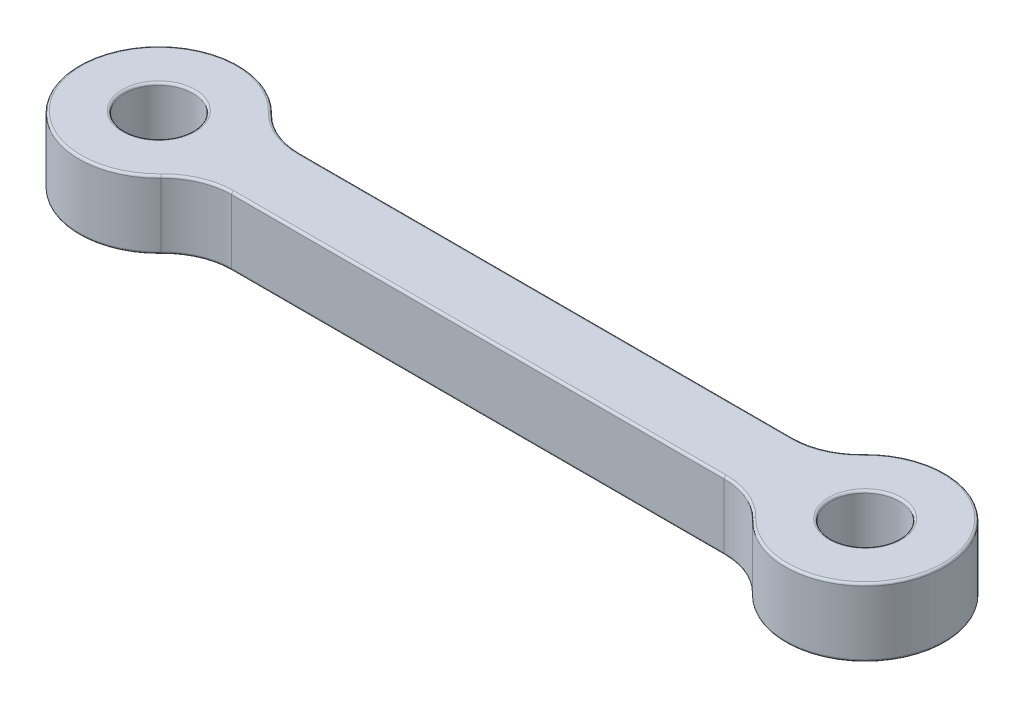
ISO-10303-21;
HEADER;
FILE_DESCRIPTION(('STEP AP214'),'2;1');
FILE_NAME('part.step','',(''),(''),'','','');
FILE_SCHEMA(('AUTOMOTIVE_DESIGN { 1 0 10303 214 1 1 1 1 }'));
ENDSEC;
DATA;
#1=APPLICATION_CONTEXT('core data for automotive mechanical design processes');
#2=APPLICATION_PROTOCOL_DEFINITION('international standard','automotive_design',2000,#1);
#3=PRODUCT_CONTEXT('',#1,'mechanical');
#4=PRODUCT('Part','Part','',(#3));
#5=PRODUCT_RELATED_PRODUCT_CATEGORY('part','',(#4));
#6=PRODUCT_DEFINITION_FORMATION('','',#4);
#7=PRODUCT_DEFINITION_CONTEXT('part definition',#1,'design');
#8=PRODUCT_DEFINITION('design','',#6,#7);
#9=PRODUCT_DEFINITION_SHAPE('','',#8);
#10=(LENGTH_UNIT() NAMED_UNIT(*) SI_UNIT(.MILLI.,.METRE.));
#11=(NAMED_UNIT(*) PLANE_ANGLE_UNIT() SI_UNIT($,.RADIAN.));
#12=(NAMED_UNIT(*) SI_UNIT($,.STERADIAN.) SOLID_ANGLE_UNIT());
#13=UNCERTAINTY_MEASURE_WITH_UNIT(LENGTH_MEASURE(1.E-05),#10,'distance_accuracy_value','');
#14=(GEOMETRIC_REPRESENTATION_CONTEXT(3) GLOBAL_UNCERTAINTY_ASSIGNED_CONTEXT((#13)) GLOBAL_UNIT_ASSIGNED_CONTEXT((#10,
#11,#12)) REPRESENTATION_CONTEXT('',''));
#15=CARTESIAN_POINT('',(0.,0.,0.));
#16=DIRECTION('',(0.,0.,1.));
#17=DIRECTION('',(1.,0.,0.));
#18=AXIS2_PLACEMENT_3D('',#15,#16,#17);
#19=CARTESIAN_POINT('',(-12.4,4.2,-2.7));
#20=DIRECTION('',(0.,0.,-1.));
#21=DIRECTION('',(-1.,0.,0.));
#22=AXIS2_PLACEMENT_3D('',#19,#20,#21);
#23=PLANE('',#22);
#24=DIRECTION('',(0.,-1.,0.));
#25=VECTOR('',#24,1.);
#26=CARTESIAN_POINT('',(34.9572516323178,4.2,-2.7));
#27=LINE('',#26,#25);
#28=CARTESIAN_POINT('',(34.9572516323178,4.02,-2.7));
#29=VERTEX_POINT('',#28);
#30=CARTESIAN_POINT('',(34.9572516323178,-1.02,-2.7));
#31=VERTEX_POINT('',#30);
#32=EDGE_CURVE('E295',#29,#31,#27,.T.);
#33=ORIENTED_EDGE('',*,*,#32,.T.);
#34=DIRECTION('',(1.,0.,0.));
#35=VECTOR('',#34,1.);
#36=CARTESIAN_POINT('',(-3.95725163231782,-1.02,-2.7));
#37=LINE('',#36,#35);
#38=CARTESIAN_POINT('',(-3.95725163231782,-1.02,-2.7));
#39=VERTEX_POINT('',#38);
#40=EDGE_CURVE('E242',#31,#39,#37,.F.);
#41=ORIENTED_EDGE('',*,*,#40,.T.);
#42=DIRECTION('',(0.,-1.,0.));
#43=VECTOR('',#42,1.);
#44=CARTESIAN_POINT('',(-3.95725163231782,4.2,-2.7));
#45=LINE('',#44,#43);
#46=CARTESIAN_POINT('',(-3.95725163231782,4.02,-2.7));
#47=VERTEX_POINT('',#46);
#48=EDGE_CURVE('E175',#47,#39,#45,.T.);
#49=ORIENTED_EDGE('',*,*,#48,.F.);
#50=DIRECTION('',(1.,0.,0.));
#51=VECTOR('',#50,1.);
#52=CARTESIAN_POINT('',(-12.4,4.02,-2.7));
#53=LINE('',#52,#51);
#54=EDGE_CURVE('E240',#47,#29,#53,.T.);
#55=ORIENTED_EDGE('',*,*,#54,.T.);
#56=EDGE_LOOP('',(#33,#41,#49,#55));
#57=FACE_BOUND('',#56,.T.);
#58=ADVANCED_FACE('F39',(#57),#23,.T.);
#59=CARTESIAN_POINT('',(-3.95725163231782,4.2,-8.1));
#60=DIRECTION('',(0.,-1.,0.));
#61=DIRECTION('',(0.,0.,-1.));
#62=AXIS2_PLACEMENT_3D('',#59,#60,#61);
#63=CYLINDRICAL_SURFACE('',#62,5.4);
#64=ORIENTED_EDGE('',*,*,#48,.T.);
#65=CARTESIAN_POINT('',(-3.95725163231782,-1.02,-8.1));
#66=DIRECTION('',(0.,1.,0.));
#67=DIRECTION('',(0.,0.,1.));
#68=AXIS2_PLACEMENT_3D('',#65,#66,#67);
#69=CIRCLE('',#68,5.4);
#70=CARTESIAN_POINT('',(-7.85390472509421,-1.02,-4.36153846153846));
#71=VERTEX_POINT('',#70);
#72=EDGE_CURVE('E174',#39,#71,#69,.F.);
#73=ORIENTED_EDGE('',*,*,#72,.T.);
#74=DIRECTION('',(0.,-1.,0.));
#75=VECTOR('',#74,1.);
#76=CARTESIAN_POINT('',(-7.85390472509421,4.2,-4.36153846153846));
#77=LINE('',#76,#75);
#78=CARTESIAN_POINT('',(-7.85390472509421,4.02,-4.36153846153846));
#79=VERTEX_POINT('',#78);
#80=EDGE_CURVE('E156',#79,#71,#77,.T.);
#81=ORIENTED_EDGE('',*,*,#80,.F.);
#82=CARTESIAN_POINT('',(-3.95725163231782,4.02,-8.1));
#83=DIRECTION('',(0.,1.,0.));
#84=DIRECTION('',(0.,0.,1.));
#85=AXIS2_PLACEMENT_3D('',#82,#83,#84);
#86=CIRCLE('',#85,5.4);
#87=EDGE_CURVE('E171',#79,#47,#86,.T.);
#88=ORIENTED_EDGE('',*,*,#87,.T.);
#89=EDGE_LOOP('',(#64,#73,#81,#88));
#90=FACE_BOUND('',#89,.T.);
#91=ADVANCED_FACE('F169',(#90),#63,.F.);
#92=CARTESIAN_POINT('',(-12.4,4.2,0.));
#93=DIRECTION('',(0.,-1.,0.));
#94=DIRECTION('',(0.,0.,-1.));
#95=AXIS2_PLACEMENT_3D('',#92,#93,#94);
#96=CYLINDRICAL_SURFACE('',#95,6.3);
#97=ORIENTED_EDGE('',*,*,#80,.T.);
#98=CARTESIAN_POINT('',(-12.4,-1.02,0.));
#99=DIRECTION('',(0.,1.,0.));
#100=DIRECTION('',(0.,0.,1.));
#101=AXIS2_PLACEMENT_3D('',#98,#99,#100);
#102=CIRCLE('',#101,6.3);
#103=CARTESIAN_POINT('',(-7.85390472509421,-1.02,4.36153846153846));
#104=VERTEX_POINT('',#103);
#105=EDGE_CURVE('E163',#71,#104,#102,.T.);
#106=ORIENTED_EDGE('',*,*,#105,.T.);
#107=DIRECTION('',(0.,-1.,0.));
#108=VECTOR('',#107,1.);
#109=CARTESIAN_POINT('',(-7.85390472509421,4.2,4.36153846153846));
#110=LINE('',#109,#108);
#111=CARTESIAN_POINT('',(-7.85390472509421,4.02,4.36153846153846));
#112=VERTEX_POINT('',#111);
#113=EDGE_CURVE('E158',#112,#104,#110,.T.);
#114=ORIENTED_EDGE('',*,*,#113,.F.);
#115=CARTESIAN_POINT('',(-12.4,4.02,0.));
#116=DIRECTION('',(0.,1.,0.));
#117=DIRECTION('',(0.,0.,1.));
#118=AXIS2_PLACEMENT_3D('',#115,#116,#117);
#119=CIRCLE('',#118,6.3);
#120=EDGE_CURVE('E153',#112,#79,#119,.F.);
#121=ORIENTED_EDGE('',*,*,#120,.T.);
#122=EDGE_LOOP('',(#97,#106,#114,#121));
#123=FACE_BOUND('',#122,.T.);
#124=ADVANCED_FACE('F155',(#123),#96,.T.);
#125=CARTESIAN_POINT('',(-3.95725163231782,4.2,8.1));
#126=DIRECTION('',(0.,-1.,0.));
#127=DIRECTION('',(0.,0.,-1.));
#128=AXIS2_PLACEMENT_3D('',#125,#126,#127);
#129=CYLINDRICAL_SURFACE('',#128,5.4);
#130=ORIENTED_EDGE('',*,*,#113,.T.);
#131=CARTESIAN_POINT('',(-3.95725163231782,-1.02,8.1));
#132=DIRECTION('',(0.,1.,0.));
#133=DIRECTION('',(0.,0.,1.));
#134=AXIS2_PLACEMENT_3D('',#131,#132,#133);
#135=CIRCLE('',#134,5.4);
#136=CARTESIAN_POINT('',(-3.95725163231782,-1.02,2.7));
#137=VERTEX_POINT('',#136);
#138=EDGE_CURVE('E221',#104,#137,#135,.F.);
#139=ORIENTED_EDGE('',*,*,#138,.T.);
#140=DIRECTION('',(0.,-1.,0.));
#141=VECTOR('',#140,1.);
#142=CARTESIAN_POINT('',(-3.95725163231782,4.2,2.7));
#143=LINE('',#142,#141);
#144=CARTESIAN_POINT('',(-3.95725163231782,4.02,2.7));
#145=VERTEX_POINT('',#144);
#146=EDGE_CURVE('E341',#145,#137,#143,.T.);
#147=ORIENTED_EDGE('',*,*,#146,.F.);
#148=CARTESIAN_POINT('',(-3.95725163231782,4.02,8.1));
#149=DIRECTION('',(0.,1.,0.));
#150=DIRECTION('',(0.,0.,1.));
#151=AXIS2_PLACEMENT_3D('',#148,#149,#150);
#152=CIRCLE('',#151,5.4);
#153=EDGE_CURVE('E219',#145,#112,#152,.T.);
#154=ORIENTED_EDGE('',*,*,#153,.T.);
#155=EDGE_LOOP('',(#130,#139,#147,#154));
#156=FACE_BOUND('',#155,.T.);
#157=ADVANCED_FACE('F346',(#156),#129,.F.);
#158=CARTESIAN_POINT('',(-12.4,4.2,2.7));
#159=DIRECTION('',(0.,0.,-1.));
#160=DIRECTION('',(-1.,0.,0.));
#161=AXIS2_PLACEMENT_3D('',#158,#159,#160);
#162=PLANE('',#161);
#163=ORIENTED_EDGE('',*,*,#146,.T.);
#164=DIRECTION('',(1.,0.,0.));
#165=VECTOR('',#164,1.);
#166=CARTESIAN_POINT('',(-12.4,-1.02,2.7));
#167=LINE('',#166,#165);
#168=CARTESIAN_POINT('',(34.9572516323178,-1.02,2.7));
#169=VERTEX_POINT('',#168);
#170=EDGE_CURVE('E225',#137,#169,#167,.T.);
#171=ORIENTED_EDGE('',*,*,#170,.T.);
#172=DIRECTION('',(0.,-1.,0.));
#173=VECTOR('',#172,1.);
#174=CARTESIAN_POINT('',(34.9572516323178,4.2,2.7));
#175=LINE('',#174,#173);
#176=CARTESIAN_POINT('',(34.9572516323178,4.02,2.7));
#177=VERTEX_POINT('',#176);
#178=EDGE_CURVE('E338',#177,#169,#175,.T.);
#179=ORIENTED_EDGE('',*,*,#178,.F.);
#180=DIRECTION('',(1.,0.,0.));
#181=VECTOR('',#180,1.);
#182=CARTESIAN_POINT('',(-3.95725163231782,4.02,2.7));
#183=LINE('',#182,#181);
#184=EDGE_CURVE('E223',#177,#145,#183,.F.);
#185=ORIENTED_EDGE('',*,*,#184,.T.);
#186=EDGE_LOOP('',(#163,#171,#179,#185));
#187=FACE_BOUND('',#186,.T.);
#188=ADVANCED_FACE('F389',(#187),#162,.F.);
#189=CARTESIAN_POINT('',(34.9572516323178,4.2,8.1));
#190=DIRECTION('',(0.,-1.,0.));
#191=DIRECTION('',(0.,0.,-1.));
#192=AXIS2_PLACEMENT_3D('',#189,#190,#191);
#193=CYLINDRICAL_SURFACE('',#192,5.4);
#194=ORIENTED_EDGE('',*,*,#178,.T.);
#195=CARTESIAN_POINT('',(34.9572516323178,-1.02,8.1));
#196=DIRECTION('',(0.,1.,0.));
#197=DIRECTION('',(0.,0.,1.));
#198=AXIS2_PLACEMENT_3D('',#195,#196,#197);
#199=CIRCLE('',#198,5.4);
#200=CARTESIAN_POINT('',(38.8539047250942,-1.02,4.36153846153846));
#201=VERTEX_POINT('',#200);
#202=EDGE_CURVE('E229',#169,#201,#199,.F.);
#203=ORIENTED_EDGE('',*,*,#202,.T.);
#204=DIRECTION('',(0.,-1.,0.));
#205=VECTOR('',#204,1.);
#206=CARTESIAN_POINT('',(38.8539047250942,4.2,4.36153846153846));
#207=LINE('',#206,#205);
#208=CARTESIAN_POINT('',(38.8539047250942,4.02,4.36153846153846));
#209=VERTEX_POINT('',#208);
#210=EDGE_CURVE('E333',#209,#201,#207,.T.);
#211=ORIENTED_EDGE('',*,*,#210,.F.);
#212=CARTESIAN_POINT('',(34.9572516323178,4.02,8.1));
#213=DIRECTION('',(0.,1.,0.));
#214=DIRECTION('',(0.,0.,1.));
#215=AXIS2_PLACEMENT_3D('',#212,#213,#214);
#216=CIRCLE('',#215,5.4);
#217=EDGE_CURVE('E227',#209,#177,#216,.T.);
#218=ORIENTED_EDGE('',*,*,#217,.T.);
#219=EDGE_LOOP('',(#194,#203,#211,#218));
#220=FACE_BOUND('',#219,.T.);
#221=ADVANCED_FACE('F391',(#220),#193,.F.);
#222=CARTESIAN_POINT('',(43.4,4.2,0.));
#223=DIRECTION('',(0.,-1.,0.));
#224=DIRECTION('',(0.,0.,-1.));
#225=AXIS2_PLACEMENT_3D('',#222,#223,#224);
#226=CYLINDRICAL_SURFACE('',#225,6.3);
#227=ORIENTED_EDGE('',*,*,#210,.T.);
#228=CARTESIAN_POINT('',(43.4,-1.02,0.));
#229=DIRECTION('',(0.,1.,0.));
#230=DIRECTION('',(0.,0.,1.));
#231=AXIS2_PLACEMENT_3D('',#228,#229,#230);
#232=CIRCLE('',#231,6.3);
#233=CARTESIAN_POINT('',(38.8539047250942,-1.02,-4.36153846153846));
#234=VERTEX_POINT('',#233);
#235=EDGE_CURVE('E233',#201,#234,#232,.T.);
#236=ORIENTED_EDGE('',*,*,#235,.T.);
#237=DIRECTION('',(0.,-1.,0.));
#238=VECTOR('',#237,1.);
#239=CARTESIAN_POINT('',(38.8539047250942,4.2,-4.36153846153846));
#240=LINE('',#239,#238);
#241=CARTESIAN_POINT('',(38.8539047250942,4.02,-4.36153846153846));
#242=VERTEX_POINT('',#241);
#243=EDGE_CURVE('E331',#242,#234,#240,.T.);
#244=ORIENTED_EDGE('',*,*,#243,.F.);
#245=CARTESIAN_POINT('',(43.4,4.02,0.));
#246=DIRECTION('',(0.,1.,0.));
#247=DIRECTION('',(0.,0.,1.));
#248=AXIS2_PLACEMENT_3D('',#245,#246,#247);
#249=CIRCLE('',#248,6.3);
#250=EDGE_CURVE('E231',#242,#209,#249,.F.);
#251=ORIENTED_EDGE('',*,*,#250,.T.);
#252=EDGE_LOOP('',(#227,#236,#244,#251));
#253=FACE_BOUND('',#252,.T.);
#254=ADVANCED_FACE('F424',(#253),#226,.T.);
#255=CARTESIAN_POINT('',(43.4,4.2,0.));
#256=DIRECTION('',(0.,-1.,0.));
#257=DIRECTION('',(0.,0.,-1.));
#258=AXIS2_PLACEMENT_3D('',#255,#256,#257);
#259=CYLINDRICAL_SURFACE('',#258,2.70000000000001);
#260=CARTESIAN_POINT('',(43.4,-1.02,0.));
#261=DIRECTION('',(0.,1.,0.));
#262=DIRECTION('',(0.,0.,1.));
#263=AXIS2_PLACEMENT_3D('',#260,#261,#262);
#264=CIRCLE('',#263,2.70000000000001);
#265=CARTESIAN_POINT('',(43.4,-1.02,2.70000000000001));
#266=VERTEX_POINT('',#265);
#267=EDGE_CURVE('E247',#266,#266,#264,.F.);
#268=ORIENTED_EDGE('',*,*,#267,.T.);
#269=EDGE_LOOP('',(#268));
#270=FACE_BOUND('',#269,.T.);
#271=CARTESIAN_POINT('',(43.4,4.02,0.));
#272=DIRECTION('',(0.,1.,0.));
#273=DIRECTION('',(0.,0.,1.));
#274=AXIS2_PLACEMENT_3D('',#271,#272,#273);
#275=CIRCLE('',#274,2.70000000000001);
#276=CARTESIAN_POINT('',(43.4,4.02,2.70000000000001));
#277=VERTEX_POINT('',#276);
#278=EDGE_CURVE('E244',#277,#277,#275,.T.);
#279=ORIENTED_EDGE('',*,*,#278,.T.);
#280=EDGE_LOOP('',(#279));
#281=FACE_BOUND('',#280,.T.);
#282=ADVANCED_FACE('F420',(#270,#281),#259,.F.);
#283=CARTESIAN_POINT('',(-12.4,4.2,0.));
#284=DIRECTION('',(0.,-1.,0.));
#285=DIRECTION('',(0.,0.,-1.));
#286=AXIS2_PLACEMENT_3D('',#283,#284,#285);
#287=CYLINDRICAL_SURFACE('',#286,2.7);
#288=CARTESIAN_POINT('',(-12.4,-1.02,0.));
#289=DIRECTION('',(0.,1.,0.));
#290=DIRECTION('',(0.,0.,1.));
#291=AXIS2_PLACEMENT_3D('',#288,#289,#290);
#292=CIRCLE('',#291,2.7);
#293=CARTESIAN_POINT('',(-12.4,-1.02,2.7));
#294=VERTEX_POINT('',#293);
#295=EDGE_CURVE('E253',#294,#294,#292,.F.);
#296=ORIENTED_EDGE('',*,*,#295,.T.);
#297=EDGE_LOOP('',(#296));
#298=FACE_BOUND('',#297,.T.);
#299=CARTESIAN_POINT('',(-12.4,4.02,0.));
#300=DIRECTION('',(0.,1.,0.));
#301=DIRECTION('',(0.,0.,1.));
#302=AXIS2_PLACEMENT_3D('',#299,#300,#301);
#303=CIRCLE('',#302,2.7);
#304=CARTESIAN_POINT('',(-12.4,4.02,2.7));
#305=VERTEX_POINT('',#304);
#306=EDGE_CURVE('E250',#305,#305,#303,.T.);
#307=ORIENTED_EDGE('',*,*,#306,.T.);
#308=EDGE_LOOP('',(#307));
#309=FACE_BOUND('',#308,.T.);
#310=ADVANCED_FACE('F423',(#298,#309),#287,.F.);
#311=CARTESIAN_POINT('',(34.9572516323178,4.2,-8.1));
#312=DIRECTION('',(0.,-1.,0.));
#313=DIRECTION('',(0.,0.,-1.));
#314=AXIS2_PLACEMENT_3D('',#311,#312,#313);
#315=CYLINDRICAL_SURFACE('',#314,5.4);
#316=ORIENTED_EDGE('',*,*,#243,.T.);
#317=CARTESIAN_POINT('',(34.9572516323178,-1.02,-8.1));
#318=DIRECTION('',(0.,1.,0.));
#319=DIRECTION('',(0.,0.,1.));
#320=AXIS2_PLACEMENT_3D('',#317,#318,#319);
#321=CIRCLE('',#320,5.4);
#322=EDGE_CURVE('E238',#234,#31,#321,.F.);
#323=ORIENTED_EDGE('',*,*,#322,.T.);
#324=ORIENTED_EDGE('',*,*,#32,.F.);
#325=CARTESIAN_POINT('',(34.9572516323178,4.02,-8.1));
#326=DIRECTION('',(0.,1.,0.));
#327=DIRECTION('',(0.,0.,1.));
#328=AXIS2_PLACEMENT_3D('',#325,#326,#327);
#329=CIRCLE('',#328,5.4);
#330=EDGE_CURVE('E235',#29,#242,#329,.T.);
#331=ORIENTED_EDGE('',*,*,#330,.T.);
#332=EDGE_LOOP('',(#316,#323,#324,#331));
#333=FACE_BOUND('',#332,.T.);
#334=ADVANCED_FACE('F328',(#333),#315,.F.);
#335=CARTESIAN_POINT('',(-12.4,4.2,0.));
#336=DIRECTION('',(0.,1.,0.));
#337=DIRECTION('',(0.,0.,1.));
#338=AXIS2_PLACEMENT_3D('',#335,#336,#337);
#339=PLANE('',#338);
#340=CARTESIAN_POINT('',(43.4,4.2,0.));
#341=DIRECTION('',(0.,1.,0.));
#342=DIRECTION('',(0.,0.,1.));
#343=AXIS2_PLACEMENT_3D('',#340,#341,#342);
#344=CIRCLE('',#343,6.12);
#345=CARTESIAN_POINT('',(38.9837931615201,4.2,4.23692307692308));
#346=VERTEX_POINT('',#345);
#347=CARTESIAN_POINT('',(38.9837931615201,4.2,-4.23692307692308));
#348=VERTEX_POINT('',#347);
#349=EDGE_CURVE('E48',#346,#348,#344,.T.);
#350=ORIENTED_EDGE('',*,*,#349,.T.);
#351=CARTESIAN_POINT('',(34.9572516323178,4.2,-8.1));
#352=DIRECTION('',(0.,1.,0.));
#353=DIRECTION('',(0.,0.,1.));
#354=AXIS2_PLACEMENT_3D('',#351,#352,#353);
#355=CIRCLE('',#354,5.58);
#356=CARTESIAN_POINT('',(34.9572516323178,4.2,-2.52));
#357=VERTEX_POINT('',#356);
#358=EDGE_CURVE('E11',#348,#357,#355,.F.);
#359=ORIENTED_EDGE('',*,*,#358,.T.);
#360=DIRECTION('',(1.,0.,0.));
#361=VECTOR('',#360,1.);
#362=CARTESIAN_POINT('',(-12.4,4.2,-2.52));
#363=LINE('',#362,#361);
#364=CARTESIAN_POINT('',(-3.95725163231782,4.2,-2.52));
#365=VERTEX_POINT('',#364);
#366=EDGE_CURVE('E262',#357,#365,#363,.F.);
#367=ORIENTED_EDGE('',*,*,#366,.T.);
#368=CARTESIAN_POINT('',(-3.95725163231782,4.2,-8.1));
#369=DIRECTION('',(0.,1.,0.));
#370=DIRECTION('',(0.,0.,1.));
#371=AXIS2_PLACEMENT_3D('',#368,#369,#370);
#372=CIRCLE('',#371,5.58);
#373=CARTESIAN_POINT('',(-7.98379316152008,4.2,-4.23692307692308));
#374=VERTEX_POINT('',#373);
#375=EDGE_CURVE('E264',#365,#374,#372,.F.);
#376=ORIENTED_EDGE('',*,*,#375,.T.);
#377=CARTESIAN_POINT('',(-12.4,4.2,0.));
#378=DIRECTION('',(0.,1.,0.));
#379=DIRECTION('',(0.,0.,1.));
#380=AXIS2_PLACEMENT_3D('',#377,#378,#379);
#381=CIRCLE('',#380,6.12);
#382=CARTESIAN_POINT('',(-7.98379316152008,4.2,4.23692307692308));
#383=VERTEX_POINT('',#382);
#384=EDGE_CURVE('E181',#374,#383,#381,.T.);
#385=ORIENTED_EDGE('',*,*,#384,.T.);
#386=CARTESIAN_POINT('',(-3.95725163231782,4.2,8.1));
#387=DIRECTION('',(0.,1.,0.));
#388=DIRECTION('',(0.,0.,1.));
#389=AXIS2_PLACEMENT_3D('',#386,#387,#388);
#390=CIRCLE('',#389,5.58);
#391=CARTESIAN_POINT('',(-3.95725163231782,4.2,2.52));
#392=VERTEX_POINT('',#391);
#393=EDGE_CURVE('E267',#383,#392,#390,.F.);
#394=ORIENTED_EDGE('',*,*,#393,.T.);
#395=DIRECTION('',(1.,0.,0.));
#396=VECTOR('',#395,1.);
#397=CARTESIAN_POINT('',(34.9572516323178,4.2,2.52));
#398=LINE('',#397,#396);
#399=CARTESIAN_POINT('',(34.9572516323178,4.2,2.52));
#400=VERTEX_POINT('',#399);
#401=EDGE_CURVE('E269',#392,#400,#398,.T.);
#402=ORIENTED_EDGE('',*,*,#401,.T.);
#403=CARTESIAN_POINT('',(34.9572516323178,4.2,8.1));
#404=DIRECTION('',(0.,1.,0.));
#405=DIRECTION('',(0.,0.,1.));
#406=AXIS2_PLACEMENT_3D('',#403,#404,#405);
#407=CIRCLE('',#406,5.58);
#408=EDGE_CURVE('E59',#400,#346,#407,.F.);
#409=ORIENTED_EDGE('',*,*,#408,.T.);
#410=EDGE_LOOP('',(#350,#359,#367,#376,#385,#394,#402,#409));
#411=FACE_BOUND('',#410,.T.);
#412=CARTESIAN_POINT('',(43.4,4.2,0.));
#413=DIRECTION('',(0.,1.,0.));
#414=DIRECTION('',(0.,0.,1.));
#415=AXIS2_PLACEMENT_3D('',#412,#413,#414);
#416=CIRCLE('',#415,2.88000000000001);
#417=CARTESIAN_POINT('',(43.4,4.2,2.88000000000001));
#418=VERTEX_POINT('',#417);
#419=EDGE_CURVE('E259',#418,#418,#416,.F.);
#420=ORIENTED_EDGE('',*,*,#419,.T.);
#421=EDGE_LOOP('',(#420));
#422=FACE_BOUND('',#421,.T.);
#423=CARTESIAN_POINT('',(-12.4,4.2,0.));
#424=DIRECTION('',(0.,1.,0.));
#425=DIRECTION('',(0.,0.,1.));
#426=AXIS2_PLACEMENT_3D('',#423,#424,#425);
#427=CIRCLE('',#426,2.88);
#428=CARTESIAN_POINT('',(-12.4,4.2,2.88));
#429=VERTEX_POINT('',#428);
#430=EDGE_CURVE('E256',#429,#429,#427,.F.);
#431=ORIENTED_EDGE('',*,*,#430,.T.);
#432=EDGE_LOOP('',(#431));
#433=FACE_BOUND('',#432,.T.);
#434=ADVANCED_FACE('F314',(#411,#422,#433),#339,.T.);
#435=CARTESIAN_POINT('',(-12.4,-1.2,0.));
#436=DIRECTION('',(0.,1.,0.));
#437=DIRECTION('',(0.,0.,1.));
#438=AXIS2_PLACEMENT_3D('',#435,#436,#437);
#439=PLANE('',#438);
#440=CARTESIAN_POINT('',(-12.4,-1.2,0.));
#441=DIRECTION('',(0.,1.,0.));
#442=DIRECTION('',(0.,0.,1.));
#443=AXIS2_PLACEMENT_3D('',#440,#441,#442);
#444=CIRCLE('',#443,6.12);
#445=CARTESIAN_POINT('',(-7.98379316152008,-1.2,4.23692307692308));
#446=VERTEX_POINT('',#445);
#447=CARTESIAN_POINT('',(-7.98379316152008,-1.2,-4.23692307692308));
#448=VERTEX_POINT('',#447);
#449=EDGE_CURVE('E214',#446,#448,#444,.F.);
#450=ORIENTED_EDGE('',*,*,#449,.T.);
#451=CARTESIAN_POINT('',(-3.95725163231782,-1.2,-8.1));
#452=DIRECTION('',(0.,1.,0.));
#453=DIRECTION('',(0.,0.,1.));
#454=AXIS2_PLACEMENT_3D('',#451,#452,#453);
#455=CIRCLE('',#454,5.58);
#456=CARTESIAN_POINT('',(-3.95725163231782,-1.2,-2.52));
#457=VERTEX_POINT('',#456);
#458=EDGE_CURVE('E164',#448,#457,#455,.T.);
#459=ORIENTED_EDGE('',*,*,#458,.T.);
#460=DIRECTION('',(1.,0.,0.));
#461=VECTOR('',#460,1.);
#462=CARTESIAN_POINT('',(34.9572516323178,-1.2,-2.52));
#463=LINE('',#462,#461);
#464=CARTESIAN_POINT('',(34.9572516323178,-1.2,-2.52));
#465=VERTEX_POINT('',#464);
#466=EDGE_CURVE('E202',#457,#465,#463,.T.);
#467=ORIENTED_EDGE('',*,*,#466,.T.);
#468=CARTESIAN_POINT('',(34.9572516323178,-1.2,-8.1));
#469=DIRECTION('',(0.,1.,0.));
#470=DIRECTION('',(0.,0.,1.));
#471=AXIS2_PLACEMENT_3D('',#468,#469,#470);
#472=CIRCLE('',#471,5.58);
#473=CARTESIAN_POINT('',(38.9837931615201,-1.2,-4.23692307692308));
#474=VERTEX_POINT('',#473);
#475=EDGE_CURVE('E204',#465,#474,#472,.T.);
#476=ORIENTED_EDGE('',*,*,#475,.T.);
#477=CARTESIAN_POINT('',(43.4,-1.2,0.));
#478=DIRECTION('',(0.,1.,0.));
#479=DIRECTION('',(0.,0.,1.));
#480=AXIS2_PLACEMENT_3D('',#477,#478,#479);
#481=CIRCLE('',#480,6.12);
#482=CARTESIAN_POINT('',(38.9837931615201,-1.2,4.23692307692308));
#483=VERTEX_POINT('',#482);
#484=EDGE_CURVE('E206',#474,#483,#481,.F.);
#485=ORIENTED_EDGE('',*,*,#484,.T.);
#486=CARTESIAN_POINT('',(34.9572516323178,-1.2,8.1));
#487=DIRECTION('',(0.,1.,0.));
#488=DIRECTION('',(0.,0.,1.));
#489=AXIS2_PLACEMENT_3D('',#486,#487,#488);
#490=CIRCLE('',#489,5.58);
#491=CARTESIAN_POINT('',(34.9572516323178,-1.2,2.52));
#492=VERTEX_POINT('',#491);
#493=EDGE_CURVE('E208',#483,#492,#490,.T.);
#494=ORIENTED_EDGE('',*,*,#493,.T.);
#495=DIRECTION('',(1.,0.,0.));
#496=VECTOR('',#495,1.);
#497=CARTESIAN_POINT('',(-12.4,-1.2,2.52));
#498=LINE('',#497,#496);
#499=CARTESIAN_POINT('',(-3.95725163231782,-1.2,2.52));
#500=VERTEX_POINT('',#499);
#501=EDGE_CURVE('E210',#492,#500,#498,.F.);
#502=ORIENTED_EDGE('',*,*,#501,.T.);
#503=CARTESIAN_POINT('',(-3.95725163231782,-1.2,8.1));
#504=DIRECTION('',(0.,1.,0.));
#505=DIRECTION('',(0.,0.,1.));
#506=AXIS2_PLACEMENT_3D('',#503,#504,#505);
#507=CIRCLE('',#506,5.58);
#508=EDGE_CURVE('E212',#500,#446,#507,.T.);
#509=ORIENTED_EDGE('',*,*,#508,.T.);
#510=EDGE_LOOP('',(#450,#459,#467,#476,#485,#494,#502,#509));
#511=FACE_BOUND('',#510,.T.);
#512=CARTESIAN_POINT('',(43.4,-1.2,0.));
#513=DIRECTION('',(0.,1.,0.));
#514=DIRECTION('',(0.,0.,1.));
#515=AXIS2_PLACEMENT_3D('',#512,#513,#514);
#516=CIRCLE('',#515,2.88000000000001);
#517=CARTESIAN_POINT('',(43.4,-1.2,2.88000000000001));
#518=VERTEX_POINT('',#517);
#519=EDGE_CURVE('E199',#518,#518,#516,.T.);
#520=ORIENTED_EDGE('',*,*,#519,.T.);
#521=EDGE_LOOP('',(#520));
#522=FACE_BOUND('',#521,.T.);
#523=CARTESIAN_POINT('',(-12.4,-1.2,0.));
#524=DIRECTION('',(0.,1.,0.));
#525=DIRECTION('',(0.,0.,1.));
#526=AXIS2_PLACEMENT_3D('',#523,#524,#525);
#527=CIRCLE('',#526,2.88);
#528=CARTESIAN_POINT('',(-12.4,-1.2,2.88));
#529=VERTEX_POINT('',#528);
#530=EDGE_CURVE('E193',#529,#529,#527,.T.);
#531=ORIENTED_EDGE('',*,*,#530,.T.);
#532=EDGE_LOOP('',(#531));
#533=FACE_BOUND('',#532,.T.);
#534=ADVANCED_FACE('F360',(#511,#522,#533),#439,.F.);
#535=CARTESIAN_POINT('',(34.9572516323178,-1.02,8.1));
#536=DIRECTION('',(0.,1.,0.));
#537=DIRECTION('',(0.,0.,1.));
#538=AXIS2_PLACEMENT_3D('',#535,#536,#537);
#539=TOROIDAL_SURFACE('',#538,5.58,0.18);
#540=CARTESIAN_POINT('',(34.9572516323178,-1.02,2.52));
#541=DIRECTION('',(-1.,0.,0.));
#542=DIRECTION('',(0.,0.,1.));
#543=AXIS2_PLACEMENT_3D('',#540,#541,#542);
#544=CIRCLE('',#543,0.18);
#545=EDGE_CURVE('E289',#492,#169,#544,.T.);
#546=ORIENTED_EDGE('',*,*,#545,.F.);
#547=ORIENTED_EDGE('',*,*,#493,.F.);
#548=CARTESIAN_POINT('',(38.9837931615201,-1.02,4.23692307692308));
#549=DIRECTION('',(0.692307692307693,0.,0.72160242458822));
#550=DIRECTION('',(0.72160242458822,0.,-0.692307692307693));
#551=AXIS2_PLACEMENT_3D('',#548,#549,#550);
#552=CIRCLE('',#551,0.18);
#553=EDGE_CURVE('E292',#201,#483,#552,.T.);
#554=ORIENTED_EDGE('',*,*,#553,.F.);
#555=ORIENTED_EDGE('',*,*,#202,.F.);
#556=EDGE_LOOP('',(#546,#547,#554,#555));
#557=FACE_BOUND('',#556,.T.);
#558=ADVANCED_FACE('F381',(#557),#539,.T.);
#559=CARTESIAN_POINT('',(43.4,-1.02,0.));
#560=DIRECTION('',(0.,1.,0.));
#561=DIRECTION('',(0.,0.,1.));
#562=AXIS2_PLACEMENT_3D('',#559,#560,#561);
#563=TOROIDAL_SURFACE('',#562,6.12,0.18);
#564=ORIENTED_EDGE('',*,*,#553,.T.);
#565=ORIENTED_EDGE('',*,*,#484,.F.);
#566=CARTESIAN_POINT('',(38.9837931615201,-1.02,-4.23692307692308));
#567=DIRECTION('',(-0.692307692307693,0.,0.72160242458822));
#568=DIRECTION('',(0.72160242458822,0.,0.692307692307693));
#569=AXIS2_PLACEMENT_3D('',#566,#567,#568);
#570=CIRCLE('',#569,0.18);
#571=EDGE_CURVE('E286',#234,#474,#570,.T.);
#572=ORIENTED_EDGE('',*,*,#571,.F.);
#573=ORIENTED_EDGE('',*,*,#235,.F.);
#574=EDGE_LOOP('',(#564,#565,#572,#573));
#575=FACE_BOUND('',#574,.T.);
#576=ADVANCED_FACE('F376',(#575),#563,.T.);
#577=CARTESIAN_POINT('',(-12.4,-1.02,2.52));
#578=DIRECTION('',(1.,0.,0.));
#579=DIRECTION('',(0.,0.,-1.));
#580=AXIS2_PLACEMENT_3D('',#577,#578,#579);
#581=CYLINDRICAL_SURFACE('',#580,0.18);
#582=ORIENTED_EDGE('',*,*,#545,.T.);
#583=ORIENTED_EDGE('',*,*,#170,.F.);
#584=CARTESIAN_POINT('',(-3.95725163231782,-1.02,2.52));
#585=DIRECTION('',(-1.,0.,0.));
#586=DIRECTION('',(0.,0.,1.));
#587=AXIS2_PLACEMENT_3D('',#584,#585,#586);
#588=CIRCLE('',#587,0.18);
#589=EDGE_CURVE('E283',#500,#137,#588,.T.);
#590=ORIENTED_EDGE('',*,*,#589,.F.);
#591=ORIENTED_EDGE('',*,*,#501,.F.);
#592=EDGE_LOOP('',(#582,#583,#590,#591));
#593=FACE_BOUND('',#592,.T.);
#594=ADVANCED_FACE('F386',(#593),#581,.T.);
#595=CARTESIAN_POINT('',(34.9572516323178,-1.02,-8.1));
#596=DIRECTION('',(0.,1.,0.));
#597=DIRECTION('',(0.,0.,1.));
#598=AXIS2_PLACEMENT_3D('',#595,#596,#597);
#599=TOROIDAL_SURFACE('',#598,5.58,0.18);
#600=ORIENTED_EDGE('',*,*,#571,.T.);
#601=ORIENTED_EDGE('',*,*,#475,.F.);
#602=CARTESIAN_POINT('',(34.9572516323178,-1.02,-2.52));
#603=DIRECTION('',(-1.,0.,0.));
#604=DIRECTION('',(0.,0.,1.));
#605=AXIS2_PLACEMENT_3D('',#602,#603,#604);
#606=CIRCLE('',#605,0.18);
#607=EDGE_CURVE('E280',#31,#465,#606,.T.);
#608=ORIENTED_EDGE('',*,*,#607,.F.);
#609=ORIENTED_EDGE('',*,*,#322,.F.);
#610=EDGE_LOOP('',(#600,#601,#608,#609));
#611=FACE_BOUND('',#610,.T.);
#612=ADVANCED_FACE('F372',(#611),#599,.T.);
#613=CARTESIAN_POINT('',(-3.95725163231782,-1.02,8.1));
#614=DIRECTION('',(0.,1.,0.));
#615=DIRECTION('',(0.,0.,1.));
#616=AXIS2_PLACEMENT_3D('',#613,#614,#615);
#617=TOROIDAL_SURFACE('',#616,5.58,0.18);
#618=ORIENTED_EDGE('',*,*,#589,.T.);
#619=ORIENTED_EDGE('',*,*,#138,.F.);
#620=CARTESIAN_POINT('',(-7.98379316152008,-1.02,4.23692307692308));
#621=DIRECTION('',(-0.692307692307693,0.,0.72160242458822));
#622=DIRECTION('',(0.72160242458822,0.,0.692307692307693));
#623=AXIS2_PLACEMENT_3D('',#620,#621,#622);
#624=CIRCLE('',#623,0.18);
#625=EDGE_CURVE('E277',#446,#104,#624,.T.);
#626=ORIENTED_EDGE('',*,*,#625,.F.);
#627=ORIENTED_EDGE('',*,*,#508,.F.);
#628=EDGE_LOOP('',(#618,#619,#626,#627));
#629=FACE_BOUND('',#628,.T.);
#630=ADVANCED_FACE('F350',(#629),#617,.T.);
#631=CARTESIAN_POINT('',(-12.4,-1.02,-2.52));
#632=DIRECTION('',(-1.,0.,0.));
#633=DIRECTION('',(0.,0.,1.));
#634=AXIS2_PLACEMENT_3D('',#631,#632,#633);
#635=CYLINDRICAL_SURFACE('',#634,0.18);
#636=ORIENTED_EDGE('',*,*,#607,.T.);
#637=ORIENTED_EDGE('',*,*,#466,.F.);
#638=CARTESIAN_POINT('',(-3.95725163231782,-1.02,-2.52));
#639=DIRECTION('',(-1.,0.,0.));
#640=DIRECTION('',(0.,0.,1.));
#641=AXIS2_PLACEMENT_3D('',#638,#639,#640);
#642=CIRCLE('',#641,0.18);
#643=EDGE_CURVE('E275',#39,#457,#642,.T.);
#644=ORIENTED_EDGE('',*,*,#643,.F.);
#645=ORIENTED_EDGE('',*,*,#40,.F.);
#646=EDGE_LOOP('',(#636,#637,#644,#645));
#647=FACE_BOUND('',#646,.T.);
#648=ADVANCED_FACE('F368',(#647),#635,.T.);
#649=CARTESIAN_POINT('',(-12.4,-1.02,0.));
#650=DIRECTION('',(0.,1.,0.));
#651=DIRECTION('',(0.,0.,1.));
#652=AXIS2_PLACEMENT_3D('',#649,#650,#651);
#653=TOROIDAL_SURFACE('',#652,6.12,0.18);
#654=ORIENTED_EDGE('',*,*,#625,.T.);
#655=ORIENTED_EDGE('',*,*,#105,.F.);
#656=CARTESIAN_POINT('',(-7.98379316152008,-1.02,-4.23692307692308));
#657=DIRECTION('',(0.692307692307693,0.,0.72160242458822));
#658=DIRECTION('',(0.72160242458822,0.,-0.692307692307693));
#659=AXIS2_PLACEMENT_3D('',#656,#657,#658);
#660=CIRCLE('',#659,0.18);
#661=EDGE_CURVE('E273',#448,#71,#660,.T.);
#662=ORIENTED_EDGE('',*,*,#661,.F.);
#663=ORIENTED_EDGE('',*,*,#449,.F.);
#664=EDGE_LOOP('',(#654,#655,#662,#663));
#665=FACE_BOUND('',#664,.T.);
#666=ADVANCED_FACE('F356',(#665),#653,.T.);
#667=CARTESIAN_POINT('',(-3.95725163231782,-1.02,-8.1));
#668=DIRECTION('',(0.,1.,0.));
#669=DIRECTION('',(0.,0.,1.));
#670=AXIS2_PLACEMENT_3D('',#667,#668,#669);
#671=TOROIDAL_SURFACE('',#670,5.58,0.18);
#672=ORIENTED_EDGE('',*,*,#643,.T.);
#673=ORIENTED_EDGE('',*,*,#458,.F.);
#674=ORIENTED_EDGE('',*,*,#661,.T.);
#675=ORIENTED_EDGE('',*,*,#72,.F.);
#676=EDGE_LOOP('',(#672,#673,#674,#675));
#677=FACE_BOUND('',#676,.T.);
#678=ADVANCED_FACE('F363',(#677),#671,.T.);
#679=CARTESIAN_POINT('',(43.4,-1.02,0.));
#680=DIRECTION('',(0.,1.,0.));
#681=DIRECTION('',(0.,0.,1.));
#682=AXIS2_PLACEMENT_3D('',#679,#680,#681);
#683=TOROIDAL_SURFACE('',#682,2.88000000000001,0.18);
#684=ORIENTED_EDGE('',*,*,#267,.F.);
#685=EDGE_LOOP('',(#684));
#686=FACE_BOUND('',#685,.T.);
#687=ORIENTED_EDGE('',*,*,#519,.F.);
#688=EDGE_LOOP('',(#687));
#689=FACE_BOUND('',#688,.T.);
#690=ADVANCED_FACE('F431',(#686,#689),#683,.T.);
#691=CARTESIAN_POINT('',(-12.4,-1.02,0.));
#692=DIRECTION('',(0.,1.,0.));
#693=DIRECTION('',(0.,0.,1.));
#694=AXIS2_PLACEMENT_3D('',#691,#692,#693);
#695=TOROIDAL_SURFACE('',#694,2.88,0.18);
#696=ORIENTED_EDGE('',*,*,#295,.F.);
#697=EDGE_LOOP('',(#696));
#698=FACE_BOUND('',#697,.T.);
#699=ORIENTED_EDGE('',*,*,#530,.F.);
#700=EDGE_LOOP('',(#699));
#701=FACE_BOUND('',#700,.T.);
#702=ADVANCED_FACE('F447',(#698,#701),#695,.T.);
#703=CARTESIAN_POINT('',(-3.95725163231782,4.02,8.1));
#704=DIRECTION('',(0.,1.,0.));
#705=DIRECTION('',(0.,0.,1.));
#706=AXIS2_PLACEMENT_3D('',#703,#704,#705);
#707=TOROIDAL_SURFACE('',#706,5.58,0.18);
#708=CARTESIAN_POINT('',(-3.95725163231782,4.02,2.52));
#709=DIRECTION('',(1.,0.,0.));
#710=DIRECTION('',(0.,0.,-1.));
#711=AXIS2_PLACEMENT_3D('',#708,#709,#710);
#712=CIRCLE('',#711,0.18);
#713=EDGE_CURVE('E184',#392,#145,#712,.T.);
#714=ORIENTED_EDGE('',*,*,#713,.F.);
#715=ORIENTED_EDGE('',*,*,#393,.F.);
#716=CARTESIAN_POINT('',(-7.98379316152008,4.02,4.23692307692308));
#717=DIRECTION('',(-0.692307692307693,0.,0.72160242458822));
#718=DIRECTION('',(0.72160242458822,0.,0.692307692307693));
#719=AXIS2_PLACEMENT_3D('',#716,#717,#718);
#720=CIRCLE('',#719,0.18);
#721=EDGE_CURVE('E43',#112,#383,#720,.T.);
#722=ORIENTED_EDGE('',*,*,#721,.F.);
#723=ORIENTED_EDGE('',*,*,#153,.F.);
#724=EDGE_LOOP('',(#714,#715,#722,#723));
#725=FACE_BOUND('',#724,.T.);
#726=ADVANCED_FACE('F313',(#725),#707,.T.);
#727=CARTESIAN_POINT('',(-12.4,4.02,0.));
#728=DIRECTION('',(0.,1.,0.));
#729=DIRECTION('',(0.,0.,1.));
#730=AXIS2_PLACEMENT_3D('',#727,#728,#729);
#731=TOROIDAL_SURFACE('',#730,6.12,0.18);
#732=ORIENTED_EDGE('',*,*,#721,.T.);
#733=ORIENTED_EDGE('',*,*,#384,.F.);
#734=CARTESIAN_POINT('',(-7.98379316152008,4.02,-4.23692307692308));
#735=DIRECTION('',(0.692307692307693,0.,0.72160242458822));
#736=DIRECTION('',(0.72160242458822,0.,-0.692307692307693));
#737=AXIS2_PLACEMENT_3D('',#734,#735,#736);
#738=CIRCLE('',#737,0.18);
#739=EDGE_CURVE('E179',#79,#374,#738,.T.);
#740=ORIENTED_EDGE('',*,*,#739,.F.);
#741=ORIENTED_EDGE('',*,*,#120,.F.);
#742=EDGE_LOOP('',(#732,#733,#740,#741));
#743=FACE_BOUND('',#742,.T.);
#744=ADVANCED_FACE('F180',(#743),#731,.T.);
#745=CARTESIAN_POINT('',(-12.4,4.02,2.52));
#746=DIRECTION('',(-1.,0.,0.));
#747=DIRECTION('',(0.,0.,1.));
#748=AXIS2_PLACEMENT_3D('',#745,#746,#747);
#749=CYLINDRICAL_SURFACE('',#748,0.18);
#750=ORIENTED_EDGE('',*,*,#713,.T.);
#751=ORIENTED_EDGE('',*,*,#184,.F.);
#752=CARTESIAN_POINT('',(34.9572516323178,4.02,2.52));
#753=DIRECTION('',(1.,0.,0.));
#754=DIRECTION('',(0.,0.,-1.));
#755=AXIS2_PLACEMENT_3D('',#752,#753,#754);
#756=CIRCLE('',#755,0.18);
#757=EDGE_CURVE('E185',#400,#177,#756,.T.);
#758=ORIENTED_EDGE('',*,*,#757,.F.);
#759=ORIENTED_EDGE('',*,*,#401,.F.);
#760=EDGE_LOOP('',(#750,#751,#758,#759));
#761=FACE_BOUND('',#760,.T.);
#762=ADVANCED_FACE('F590',(#761),#749,.T.);
#763=CARTESIAN_POINT('',(-3.95725163231782,4.02,-8.1));
#764=DIRECTION('',(0.,1.,0.));
#765=DIRECTION('',(0.,0.,1.));
#766=AXIS2_PLACEMENT_3D('',#763,#764,#765);
#767=TOROIDAL_SURFACE('',#766,5.58,0.18);
#768=ORIENTED_EDGE('',*,*,#739,.T.);
#769=ORIENTED_EDGE('',*,*,#375,.F.);
#770=CARTESIAN_POINT('',(-3.95725163231782,4.02,-2.52));
#771=DIRECTION('',(1.,0.,0.));
#772=DIRECTION('',(0.,0.,-1.));
#773=AXIS2_PLACEMENT_3D('',#770,#771,#772);
#774=CIRCLE('',#773,0.18);
#775=EDGE_CURVE('E190',#47,#365,#774,.T.);
#776=ORIENTED_EDGE('',*,*,#775,.F.);
#777=ORIENTED_EDGE('',*,*,#87,.F.);
#778=EDGE_LOOP('',(#768,#769,#776,#777));
#779=FACE_BOUND('',#778,.T.);
#780=ADVANCED_FACE('F188',(#779),#767,.T.);
#781=CARTESIAN_POINT('',(34.9572516323178,4.02,8.1));
#782=DIRECTION('',(0.,1.,0.));
#783=DIRECTION('',(0.,0.,1.));
#784=AXIS2_PLACEMENT_3D('',#781,#782,#783);
#785=TOROIDAL_SURFACE('',#784,5.58,0.18);
#786=ORIENTED_EDGE('',*,*,#757,.T.);
#787=ORIENTED_EDGE('',*,*,#217,.F.);
#788=CARTESIAN_POINT('',(38.9837931615201,4.02,4.23692307692308));
#789=DIRECTION('',(0.69230769230769,0.,0.721602424588222));
#790=DIRECTION('',(0.721602424588222,0.,-0.69230769230769));
#791=AXIS2_PLACEMENT_3D('',#788,#789,#790);
#792=CIRCLE('',#791,0.18);
#793=EDGE_CURVE('E300',#346,#209,#792,.T.);
#794=ORIENTED_EDGE('',*,*,#793,.F.);
#795=ORIENTED_EDGE('',*,*,#408,.F.);
#796=EDGE_LOOP('',(#786,#787,#794,#795));
#797=FACE_BOUND('',#796,.T.);
#798=ADVANCED_FACE('F395',(#797),#785,.T.);
#799=CARTESIAN_POINT('',(-12.4,4.02,-2.52));
#800=DIRECTION('',(1.,0.,0.));
#801=DIRECTION('',(0.,0.,-1.));
#802=AXIS2_PLACEMENT_3D('',#799,#800,#801);
#803=CYLINDRICAL_SURFACE('',#802,0.18);
#804=ORIENTED_EDGE('',*,*,#775,.T.);
#805=ORIENTED_EDGE('',*,*,#366,.F.);
#806=CARTESIAN_POINT('',(34.9572516323178,4.02,-2.52));
#807=DIRECTION('',(1.,0.,0.));
#808=DIRECTION('',(0.,0.,-1.));
#809=AXIS2_PLACEMENT_3D('',#806,#807,#808);
#810=CIRCLE('',#809,0.18);
#811=EDGE_CURVE('E298',#29,#357,#810,.T.);
#812=ORIENTED_EDGE('',*,*,#811,.F.);
#813=ORIENTED_EDGE('',*,*,#54,.F.);
#814=EDGE_LOOP('',(#804,#805,#812,#813));
#815=FACE_BOUND('',#814,.T.);
#816=ADVANCED_FACE('F319',(#815),#803,.T.);
#817=CARTESIAN_POINT('',(43.4,4.02,0.));
#818=DIRECTION('',(0.,1.,0.));
#819=DIRECTION('',(0.,0.,1.));
#820=AXIS2_PLACEMENT_3D('',#817,#818,#819);
#821=TOROIDAL_SURFACE('',#820,6.12,0.18);
#822=ORIENTED_EDGE('',*,*,#793,.T.);
#823=ORIENTED_EDGE('',*,*,#250,.F.);
#824=CARTESIAN_POINT('',(38.9837931615201,4.02,-4.23692307692308));
#825=DIRECTION('',(-0.69230769230769,0.,0.721602424588222));
#826=DIRECTION('',(0.721602424588222,0.,0.69230769230769));
#827=AXIS2_PLACEMENT_3D('',#824,#825,#826);
#828=CIRCLE('',#827,0.18);
#829=EDGE_CURVE('E296',#348,#242,#828,.T.);
#830=ORIENTED_EDGE('',*,*,#829,.F.);
#831=ORIENTED_EDGE('',*,*,#349,.F.);
#832=EDGE_LOOP('',(#822,#823,#830,#831));
#833=FACE_BOUND('',#832,.T.);
#834=ADVANCED_FACE('F398',(#833),#821,.T.);
#835=CARTESIAN_POINT('',(34.9572516323178,4.02,-8.1));
#836=DIRECTION('',(0.,1.,0.));
#837=DIRECTION('',(0.,0.,1.));
#838=AXIS2_PLACEMENT_3D('',#835,#836,#837);
#839=TOROIDAL_SURFACE('',#838,5.58,0.18);
#840=ORIENTED_EDGE('',*,*,#811,.T.);
#841=ORIENTED_EDGE('',*,*,#358,.F.);
#842=ORIENTED_EDGE('',*,*,#829,.T.);
#843=ORIENTED_EDGE('',*,*,#330,.F.);
#844=EDGE_LOOP('',(#840,#841,#842,#843));
#845=FACE_BOUND('',#844,.T.);
#846=ADVANCED_FACE('F401',(#845),#839,.T.);
#847=CARTESIAN_POINT('',(43.4,4.02,0.));
#848=DIRECTION('',(0.,1.,0.));
#849=DIRECTION('',(0.,0.,1.));
#850=AXIS2_PLACEMENT_3D('',#847,#848,#849);
#851=TOROIDAL_SURFACE('',#850,2.88000000000001,0.18);
#852=ORIENTED_EDGE('',*,*,#419,.F.);
#853=EDGE_LOOP('',(#852));
#854=FACE_BOUND('',#853,.T.);
#855=ORIENTED_EDGE('',*,*,#278,.F.);
#856=EDGE_LOOP('',(#855));
#857=FACE_BOUND('',#856,.T.);
#858=ADVANCED_FACE('F403',(#854,#857),#851,.T.);
#859=CARTESIAN_POINT('',(-12.4,4.02,0.));
#860=DIRECTION('',(0.,1.,0.));
#861=DIRECTION('',(0.,0.,1.));
#862=AXIS2_PLACEMENT_3D('',#859,#860,#861);
#863=TOROIDAL_SURFACE('',#862,2.88,0.18);
#864=ORIENTED_EDGE('',*,*,#430,.F.);
#865=EDGE_LOOP('',(#864));
#866=FACE_BOUND('',#865,.T.);
#867=ORIENTED_EDGE('',*,*,#306,.F.);
#868=EDGE_LOOP('',(#867));
#869=FACE_BOUND('',#868,.T.);
#870=ADVANCED_FACE('F41',(#866,#869),#863,.T.);
#871=CLOSED_SHELL('',(#58,#91,#124,#157,#188,#221,#254,#282,#310,#334,#434,#534,#558,#576,#594,
#612,#630,#648,#666,#678,#690,#702,#726,#744,#762,#780,#798,#816,#834,#846,#858,#870));
#872=MANIFOLD_SOLID_BREP('B2',#871);
#873=ADVANCED_BREP_SHAPE_REPRESENTATION('',(#18,#872),#14);
#874=SHAPE_DEFINITION_REPRESENTATION(#9,#873);
ENDSEC;
END-ISO-10303-21;
